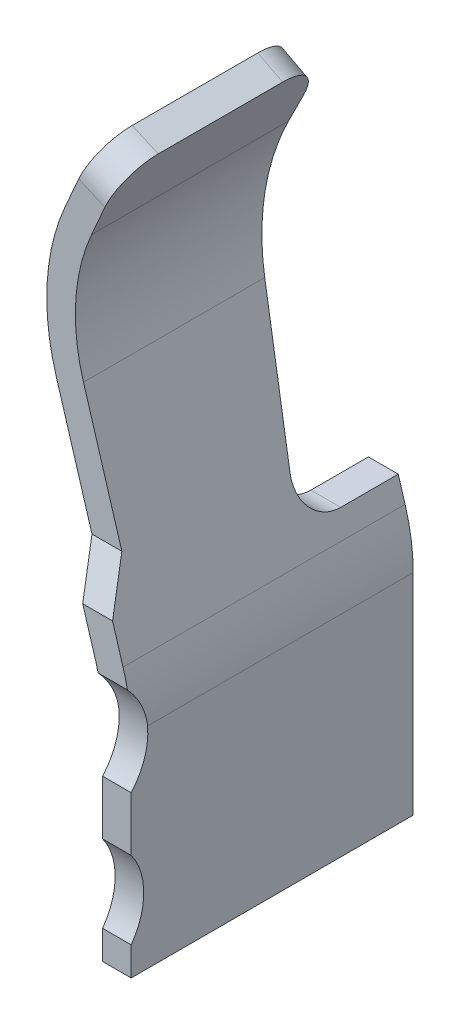
ISO-10303-21;
HEADER;
FILE_DESCRIPTION(('STEP AP214'),'2;1');
FILE_NAME('part.step','',(''),(''),'','','');
FILE_SCHEMA(('AUTOMOTIVE_DESIGN { 1 0 10303 214 1 1 1 1 }'));
ENDSEC;
DATA;
#1=APPLICATION_CONTEXT('core data for automotive mechanical design processes');
#2=APPLICATION_PROTOCOL_DEFINITION('international standard','automotive_design',2000,#1);
#3=PRODUCT_CONTEXT('',#1,'mechanical');
#4=PRODUCT('Part','Part','',(#3));
#5=PRODUCT_RELATED_PRODUCT_CATEGORY('part','',(#4));
#6=PRODUCT_DEFINITION_FORMATION('','',#4);
#7=PRODUCT_DEFINITION_CONTEXT('part definition',#1,'design');
#8=PRODUCT_DEFINITION('design','',#6,#7);
#9=PRODUCT_DEFINITION_SHAPE('','',#8);
#10=(LENGTH_UNIT() NAMED_UNIT(*) SI_UNIT(.MILLI.,.METRE.));
#11=(NAMED_UNIT(*) PLANE_ANGLE_UNIT() SI_UNIT($,.RADIAN.));
#12=(NAMED_UNIT(*) SI_UNIT($,.STERADIAN.) SOLID_ANGLE_UNIT());
#13=UNCERTAINTY_MEASURE_WITH_UNIT(LENGTH_MEASURE(1.E-05),#10,'distance_accuracy_value','');
#14=(GEOMETRIC_REPRESENTATION_CONTEXT(3) GLOBAL_UNCERTAINTY_ASSIGNED_CONTEXT((#13)) GLOBAL_UNIT_ASSIGNED_CONTEXT((#10,
#11,#12)) REPRESENTATION_CONTEXT('',''));
#15=CARTESIAN_POINT('',(0.,0.,0.));
#16=DIRECTION('',(0.,0.,1.));
#17=DIRECTION('',(1.,0.,0.));
#18=AXIS2_PLACEMENT_3D('',#15,#16,#17);
#19=CARTESIAN_POINT('',(-13.3615550668189,3.52330708865174,0.423604352914839));
#20=DIRECTION('',(0.915327071470026,-0.402711251685505,0.));
#21=DIRECTION('',(0.402711251685505,0.915327071470026,0.));
#22=AXIS2_PLACEMENT_3D('',#19,#20,#21);
#23=CYLINDRICAL_SURFACE('',#22,0.2);
#24=CARTESIAN_POINT('',(-13.3615550668189,3.52330708865174,0.423604352914839));
#25=DIRECTION('',(-0.915327071470029,0.402711251685498,0.));
#26=DIRECTION('',(0.402711251685498,0.915327071470029,0.));
#27=AXIS2_PLACEMENT_3D('',#24,#25,#26);
#28=CIRCLE('',#27,0.2);
#29=CARTESIAN_POINT('',(-13.3615550668189,3.52330708865174,0.623604352914839));
#30=VERTEX_POINT('',#29);
#31=CARTESIAN_POINT('',(-13.2810128164818,3.70637250294574,0.423604352914839));
#32=VERTEX_POINT('',#31);
#33=EDGE_CURVE('E363',#30,#32,#28,.T.);
#34=ORIENTED_EDGE('',*,*,#33,.F.);
#35=DIRECTION('',(-0.915327071470027,0.402711251685503,0.));
#36=VECTOR('',#35,1.);
#37=CARTESIAN_POINT('',(-37.9715059297134,14.3508073613119,0.623604352914805));
#38=LINE('',#37,#36);
#39=CARTESIAN_POINT('',(-13.2242560060984,3.46290040089891,0.623604352914839));
#40=VERTEX_POINT('',#39);
#41=EDGE_CURVE('E27',#40,#30,#38,.T.);
#42=ORIENTED_EDGE('',*,*,#41,.F.);
#43=CARTESIAN_POINT('',(-13.2242560060984,3.46290040089891,0.423604352914839));
#44=DIRECTION('',(0.915327071470029,-0.402711251685498,0.));
#45=DIRECTION('',(-0.402711251685498,-0.915327071470029,0.));
#46=AXIS2_PLACEMENT_3D('',#43,#44,#45);
#47=CIRCLE('',#46,0.2);
#48=CARTESIAN_POINT('',(-13.1437137557613,3.64596581519291,0.423604352914839));
#49=VERTEX_POINT('',#48);
#50=EDGE_CURVE('E224',#49,#40,#47,.T.);
#51=ORIENTED_EDGE('',*,*,#50,.F.);
#52=DIRECTION('',(0.915327071470027,-0.402711251685503,0.));
#53=VECTOR('',#52,1.);
#54=CARTESIAN_POINT('',(-13.2810128164818,3.70637250294574,0.423604352914839));
#55=LINE('',#54,#53);
#56=EDGE_CURVE('E402',#32,#49,#55,.T.);
#57=ORIENTED_EDGE('',*,*,#56,.F.);
#58=EDGE_LOOP('',(#34,#42,#51,#57));
#59=FACE_BOUND('',#58,.T.);
#60=ADVANCED_FACE('F16',(#59),#23,.T.);
#61=CARTESIAN_POINT('',(-13.38386274133,3.53312166947706,-0.236832722369337));
#62=DIRECTION('',(-0.914255270392897,0.402239697454475,-0.0483789866630451));
#63=DIRECTION('',(-0.402711251685505,-0.915327071470026,0.));
#64=AXIS2_PLACEMENT_3D('',#61,#62,#63);
#65=CYLINDRICAL_SURFACE('',#64,0.2);
#66=CARTESIAN_POINT('',(-13.2330594619542,3.44289092405021,-0.427421697659668));
#67=CARTESIAN_POINT('',(-13.1819825348076,3.55898426375477,-0.441384710680955));
#68=CARTESIAN_POINT('',(-13.1437137557613,3.64596581519291,-0.356133634256614));
#69=CARTESIAN_POINT('',(-13.1437137557613,3.64596581519291,-0.228386927890316));
#70=(BOUNDED_CURVE() B_SPLINE_CURVE(3,(#66,#67,#68,#69),.UNSPECIFIED.,.F.,
.F.) B_SPLINE_CURVE_WITH_KNOTS((4,4),(6.17366415670651,7.85398163397443),
.UNSPECIFIED.) CURVE() GEOMETRIC_REPRESENTATION_ITEM() RATIONAL_B_SPLINE_CURVE((1.,
0.778229742533869,0.778229742533869,1.)) REPRESENTATION_ITEM(''));
#71=CARTESIAN_POINT('',(-13.2330594619542,3.44289092405021,-0.427421697659668));
#72=VERTEX_POINT('',#71);
#73=CARTESIAN_POINT('',(-13.1437137557613,3.64596581519291,-0.228386927890316));
#74=VERTEX_POINT('',#73);
#75=EDGE_CURVE('E234',#72,#74,#70,.T.);
#76=ORIENTED_EDGE('',*,*,#75,.F.);
#77=DIRECTION('',(0.914255270392898,-0.402239697454473,0.0483789866630451));
#78=VECTOR('',#77,1.);
#79=CARTESIAN_POINT('',(-38.571852655037,14.5910558161891,-1.76825633941021));
#80=LINE('',#79,#78);
#81=CARTESIAN_POINT('',(-13.3703585226747,3.50329761180303,-0.434687053017796));
#82=VERTEX_POINT('',#81);
#83=EDGE_CURVE('E11',#82,#72,#80,.T.);
#84=ORIENTED_EDGE('',*,*,#83,.F.);
#85=CARTESIAN_POINT('',(-13.2810128164818,3.70637250294574,-0.235652283248443));
#86=CARTESIAN_POINT('',(-13.2810128164818,3.70637250294574,-0.363398989614741));
#87=CARTESIAN_POINT('',(-13.3192815955281,3.61939095150759,-0.448650066039082));
#88=CARTESIAN_POINT('',(-13.3703585226747,3.50329761180303,-0.434687053017796));
#89=(BOUNDED_CURVE() B_SPLINE_CURVE(3,(#85,#86,#87,#88),.UNSPECIFIED.,.F.,
.F.) B_SPLINE_CURVE_WITH_KNOTS((4,4),(4.71238898038476,6.39270645765268),
.UNSPECIFIED.) CURVE() GEOMETRIC_REPRESENTATION_ITEM() RATIONAL_B_SPLINE_CURVE((1.,
0.778229742533871,0.778229742533871,1.)) REPRESENTATION_ITEM(''));
#90=CARTESIAN_POINT('',(-13.2810128164818,3.70637250294574,-0.235652283248443));
#91=VERTEX_POINT('',#90);
#92=EDGE_CURVE('E286',#91,#82,#89,.T.);
#93=ORIENTED_EDGE('',*,*,#92,.F.);
#94=DIRECTION('',(-0.914255270392898,0.402239697454473,-0.0483789866630451));
#95=VECTOR('',#94,1.);
#96=CARTESIAN_POINT('',(-13.3033204909929,3.71618708377106,-0.236832722369337));
#97=LINE('',#96,#95);
#98=EDGE_CURVE('E362',#74,#91,#97,.T.);
#99=ORIENTED_EDGE('',*,*,#98,.F.);
#100=EDGE_LOOP('',(#76,#84,#93,#99));
#101=FACE_BOUND('',#100,.T.);
#102=ADVANCED_FACE('F700',(#101),#65,.T.);
#103=CARTESIAN_POINT('',(-43.43,1.65634067151207,-0.212546111318104));
#104=DIRECTION('',(0.,-1.,0.));
#105=DIRECTION('',(0.,0.,-1.));
#106=AXIS2_PLACEMENT_3D('',#103,#104,#105);
#107=PLANE('',#106);
#108=DIRECTION('',(0.,0.,-1.));
#109=VECTOR('',#108,1.);
#110=CARTESIAN_POINT('',(-13.2051649210585,1.65634067151207,-0.740000000000018));
#111=LINE('',#110,#109);
#112=CARTESIAN_POINT('',(-13.2051649210585,1.65634067151207,-0.438042305987952));
#113=VERTEX_POINT('',#112);
#114=CARTESIAN_POINT('',(-13.2051649210585,1.65634067151207,-0.740000000000018));
#115=VERTEX_POINT('',#114);
#116=EDGE_CURVE('E311',#113,#115,#111,.T.);
#117=ORIENTED_EDGE('',*,*,#116,.F.);
#118=DIRECTION('',(1.,0.,0.));
#119=VECTOR('',#118,1.);
#120=CARTESIAN_POINT('',(-13.0484965908944,1.65634067151207,-0.438042305987951));
#121=LINE('',#120,#119);
#122=CARTESIAN_POINT('',(-13.0484965908944,1.65634067151207,-0.438042305987951));
#123=VERTEX_POINT('',#122);
#124=EDGE_CURVE('E438',#113,#123,#121,.T.);
#125=ORIENTED_EDGE('',*,*,#124,.T.);
#126=DIRECTION('',(0.,0.,1.));
#127=VECTOR('',#126,1.);
#128=CARTESIAN_POINT('',(-13.0484965908944,1.65634067151207,-0.740000000000018));
#129=LINE('',#128,#127);
#130=CARTESIAN_POINT('',(-13.0484965908944,1.65634067151207,-0.740000000000018));
#131=VERTEX_POINT('',#130);
#132=EDGE_CURVE('E119',#131,#123,#129,.T.);
#133=ORIENTED_EDGE('',*,*,#132,.F.);
#134=DIRECTION('',(-1.,0.,0.));
#135=VECTOR('',#134,1.);
#136=CARTESIAN_POINT('',(-13.97,1.65634067151207,-0.740000000000019));
#137=LINE('',#136,#135);
#138=EDGE_CURVE('E328',#131,#115,#137,.T.);
#139=ORIENTED_EDGE('',*,*,#138,.T.);
#140=EDGE_LOOP('',(#117,#125,#133,#139));
#141=FACE_BOUND('',#140,.T.);
#142=ADVANCED_FACE('F704',(#141),#107,.F.);
#143=CARTESIAN_POINT('',(-43.43,3.70637250294571,-0.459111687165995));
#144=DIRECTION('',(0.,0.119413416546905,0.992844618230162));
#145=DIRECTION('',(1.,0.,0.));
#146=AXIS2_PLACEMENT_3D('',#143,#144,#145);
#147=PLANE('',#146);
#148=DIRECTION('',(-0.28674853992682,0.951150986717314,-0.11439875574724));
#149=VECTOR('',#148,1.);
#150=CARTESIAN_POINT('',(-13.0303360451115,1.59610175610151,-0.205300934614502));
#151=LINE('',#150,#149);
#152=CARTESIAN_POINT('',(-13.1159916925664,1.88022335482146,-0.239473382341919));
#153=VERTEX_POINT('',#152);
#154=CARTESIAN_POINT('',(-13.3365862640963,2.61194022573825,-0.327479914176621));
#155=VERTEX_POINT('',#154);
#156=EDGE_CURVE('E136',#153,#155,#151,.T.);
#157=ORIENTED_EDGE('',*,*,#156,.F.);
#158=DIRECTION('',(-1.,0.,0.));
#159=VECTOR('',#158,1.);
#160=CARTESIAN_POINT('',(-13.2051649210585,1.88022335482146,-0.23947338234192));
#161=LINE('',#160,#159);
#162=CARTESIAN_POINT('',(-13.2726600227304,1.88022335482146,-0.23947338234192));
#163=VERTEX_POINT('',#162);
#164=EDGE_CURVE('E412',#153,#163,#161,.T.);
#165=ORIENTED_EDGE('',*,*,#164,.T.);
#166=DIRECTION('',(0.286748539926818,-0.951150986717315,0.11439875574724));
#167=VECTOR('',#166,1.);
#168=CARTESIAN_POINT('',(-13.1741223648881,1.55337185451571,-0.200161637444145));
#169=LINE('',#168,#167);
#170=CARTESIAN_POINT('',(-13.4802017604538,2.56864369924933,-0.322272466749579));
#171=VERTEX_POINT('',#170);
#172=EDGE_CURVE('E256',#171,#163,#169,.T.);
#173=ORIENTED_EDGE('',*,*,#172,.F.);
#174=CARTESIAN_POINT('',(-13.4317757539039,3.36370167510267,-0.417897288102545));
#175=CARTESIAN_POINT('',(-13.5433007949067,3.11021511680704,-0.387409439934768));
#176=CARTESIAN_POINT('',(-13.560137394596,2.83379189253285,-0.354162906673266));
#177=CARTESIAN_POINT('',(-13.4802017604538,2.56864369924933,-0.322272466749579));
#178=(BOUNDED_CURVE() B_SPLINE_CURVE(3,(#174,#175,#176,#177),.UNSPECIFIED.,.F.,
.F.) B_SPLINE_CURVE_WITH_KNOTS((4,4),(4.29791199977039,5.00519872138853),
.UNSPECIFIED.) CURVE() GEOMETRIC_REPRESENTATION_ITEM() RATIONAL_B_SPLINE_CURVE((1.,
0.958744787021091,0.958744787021091,1.)) REPRESENTATION_ITEM(''));
#179=CARTESIAN_POINT('',(-13.4317757539039,3.36370167510267,-0.417897288102545));
#180=VERTEX_POINT('',#179);
#181=EDGE_CURVE('E289',#180,#171,#178,.T.);
#182=ORIENTED_EDGE('',*,*,#181,.F.);
#183=DIRECTION('',(-0.400292818236851,-0.909830186054405,0.109428936813832));
#184=VECTOR('',#183,1.);
#185=CARTESIAN_POINT('',(-13.4176664899118,3.39577078475993,-0.421754368938234));
#186=LINE('',#185,#184);
#187=EDGE_CURVE('E279',#82,#180,#186,.T.);
#188=ORIENTED_EDGE('',*,*,#187,.F.);
#189=ORIENTED_EDGE('',*,*,#83,.T.);
#190=DIRECTION('',(0.400292818236852,0.909830186054405,-0.109428936813832));
#191=VECTOR('',#190,1.);
#192=CARTESIAN_POINT('',(-13.2800491803441,3.33608744850051,-0.414576013974332));
#193=LINE('',#192,#191);
#194=CARTESIAN_POINT('',(-13.2944766931834,3.30329498734983,-0.410631932744417));
#195=VERTEX_POINT('',#194);
#196=EDGE_CURVE('E396',#195,#72,#193,.T.);
#197=ORIENTED_EDGE('',*,*,#196,.F.);
#198=CARTESIAN_POINT('',(-13.3365862640963,2.61194022573825,-0.327479914176621));
#199=CARTESIAN_POINT('',(-13.4060955111766,2.84250387207174,-0.355210731501565));
#200=CARTESIAN_POINT('',(-13.3914549897076,3.08287189317973,-0.384120760424611));
#201=CARTESIAN_POINT('',(-13.2944766931834,3.30329498734983,-0.410631932744417));
#202=(BOUNDED_CURVE() B_SPLINE_CURVE(3,(#198,#199,#200,#201),.UNSPECIFIED.,.F.,
.F.) B_SPLINE_CURVE_WITH_KNOTS((4,4),(1.27798658579106,1.98527330740919),
.UNSPECIFIED.) CURVE() GEOMETRIC_REPRESENTATION_ITEM() RATIONAL_B_SPLINE_CURVE((1.,
0.958744787021091,0.958744787021091,1.)) REPRESENTATION_ITEM(''));
#203=EDGE_CURVE('E319',#155,#195,#202,.T.);
#204=ORIENTED_EDGE('',*,*,#203,.F.);
#205=EDGE_LOOP('',(#157,#165,#173,#182,#188,#189,#197,#204));
#206=FACE_BOUND('',#205,.T.);
#207=ADVANCED_FACE('F290',(#206),#147,.F.);
#208=CARTESIAN_POINT('',(-43.43,1.94413292378283,0.623604352914797));
#209=DIRECTION('',(0.,0.,-1.));
#210=DIRECTION('',(0.,-1.,0.));
#211=AXIS2_PLACEMENT_3D('',#208,#209,#210);
#212=PLANE('',#211);
#213=DIRECTION('',(-0.402711251685501,-0.915327071470028,0.));
#214=VECTOR('',#213,1.);
#215=CARTESIAN_POINT('',(-13.2944766931834,3.30329498734984,0.623604352914839));
#216=LINE('',#215,#214);
#217=CARTESIAN_POINT('',(-13.2944766931834,3.30329498734984,0.623604352914839));
#218=VERTEX_POINT('',#217);
#219=EDGE_CURVE('E424',#40,#218,#216,.T.);
#220=ORIENTED_EDGE('',*,*,#219,.F.);
#221=ORIENTED_EDGE('',*,*,#41,.T.);
#222=DIRECTION('',(0.4027112516855,0.915327071470028,0.));
#223=VECTOR('',#222,1.);
#224=CARTESIAN_POINT('',(-13.4317757539039,3.36370167510267,0.623604352914839));
#225=LINE('',#224,#223);
#226=CARTESIAN_POINT('',(-13.4317757539039,3.36370167510267,0.623604352914839));
#227=VERTEX_POINT('',#226);
#228=EDGE_CURVE('E270',#227,#30,#225,.T.);
#229=ORIENTED_EDGE('',*,*,#228,.F.);
#230=CARTESIAN_POINT('',(-12.3791496217134,2.90058373566433,0.62360435291484));
#231=DIRECTION('',(0.,0.,-1.));
#232=DIRECTION('',(-1.,0.,0.));
#233=AXIS2_PLACEMENT_3D('',#230,#231,#232);
#234=CIRCLE('',#233,1.15);
#235=CARTESIAN_POINT('',(-13.4802017604538,2.56864369924933,0.623604352914839));
#236=VERTEX_POINT('',#235);
#237=EDGE_CURVE('E294',#236,#227,#234,.T.);
#238=ORIENTED_EDGE('',*,*,#237,.F.);
#239=DIRECTION('',(-0.288643509926088,0.957436642382956,0.));
#240=VECTOR('',#239,1.);
#241=CARTESIAN_POINT('',(-13.1561788539745,1.49385284836845,0.623604352914839));
#242=LINE('',#241,#240);
#243=CARTESIAN_POINT('',(-13.2919271799357,1.94413292378283,0.623604352914839));
#244=VERTEX_POINT('',#243);
#245=EDGE_CURVE('E305',#244,#236,#242,.T.);
#246=ORIENTED_EDGE('',*,*,#245,.F.);
#247=DIRECTION('',(1.,0.,0.));
#248=VECTOR('',#247,1.);
#249=CARTESIAN_POINT('',(-43.43,1.94413292378283,0.623604352914797));
#250=LINE('',#249,#248);
#251=CARTESIAN_POINT('',(-13.1352588497716,1.94413292378283,0.623604352914839));
#252=VERTEX_POINT('',#251);
#253=EDGE_CURVE('E332',#244,#252,#250,.T.);
#254=ORIENTED_EDGE('',*,*,#253,.T.);
#255=DIRECTION('',(0.28864350992609,-0.957436642382956,0.));
#256=VECTOR('',#255,1.);
#257=CARTESIAN_POINT('',(-13.012563357617,1.53714937485737,0.623604352914839));
#258=LINE('',#257,#256);
#259=CARTESIAN_POINT('',(-13.3365862640963,2.61194022573825,0.623604352914839));
#260=VERTEX_POINT('',#259);
#261=EDGE_CURVE('E325',#260,#252,#258,.T.);
#262=ORIENTED_EDGE('',*,*,#261,.F.);
#263=CARTESIAN_POINT('',(-12.3791496217134,2.90058373566433,0.62360435291484));
#264=DIRECTION('',(0.,0.,1.));
#265=DIRECTION('',(-1.,0.,0.));
#266=AXIS2_PLACEMENT_3D('',#263,#264,#265);
#267=CIRCLE('',#266,1.);
#268=EDGE_CURVE('E388',#218,#260,#267,.T.);
#269=ORIENTED_EDGE('',*,*,#268,.F.);
#270=EDGE_LOOP('',(#220,#221,#229,#238,#246,#254,#262,#269));
#271=FACE_BOUND('',#270,.T.);
#272=ADVANCED_FACE('F1000',(#271),#212,.F.);
#273=CARTESIAN_POINT('',(-43.43,1.7003498353216,0.749999999999972));
#274=DIRECTION('',(0.,-0.460287319631494,-0.887770005906065));
#275=DIRECTION('',(0.,-0.887770005906065,0.460287319631494));
#276=AXIS2_PLACEMENT_3D('',#273,#274,#275);
#277=PLANE('',#276);
#278=DIRECTION('',(-1.,0.,0.));
#279=VECTOR('',#278,1.);
#280=CARTESIAN_POINT('',(-13.97,1.7196371362757,0.739999999999981));
#281=LINE('',#280,#279);
#282=CARTESIAN_POINT('',(-13.0675789123207,1.7196371362757,0.739999999999982));
#283=VERTEX_POINT('',#282);
#284=CARTESIAN_POINT('',(-13.2242472424848,1.7196371362757,0.739999999999982));
#285=VERTEX_POINT('',#284);
#286=EDGE_CURVE('E446',#283,#285,#281,.T.);
#287=ORIENTED_EDGE('',*,*,#286,.F.);
#288=DIRECTION('',(0.258541028225372,-0.857586072334425,0.444637678635293));
#289=VECTOR('',#288,1.);
#290=CARTESIAN_POINT('',(-13.1935765616936,2.13757401070795,0.523309818502748));
#291=LINE('',#290,#289);
#292=EDGE_CURVE('E321',#252,#283,#291,.T.);
#293=ORIENTED_EDGE('',*,*,#292,.F.);
#294=ORIENTED_EDGE('',*,*,#253,.F.);
#295=DIRECTION('',(-0.258541028225371,0.857586072334425,-0.444637678635293));
#296=VECTOR('',#295,1.);
#297=CARTESIAN_POINT('',(-13.3397726380838,2.10283732290249,0.541319952677684));
#298=LINE('',#297,#296);
#299=EDGE_CURVE('E431',#285,#244,#298,.T.);
#300=ORIENTED_EDGE('',*,*,#299,.F.);
#301=EDGE_LOOP('',(#287,#293,#294,#300));
#302=FACE_BOUND('',#301,.T.);
#303=ADVANCED_FACE('F533',(#302),#277,.F.);
#304=CARTESIAN_POINT('',(-13.97,1.24850586493128,0.739999999999981));
#305=DIRECTION('',(0.,0.,-1.));
#306=DIRECTION('',(0.,-1.,0.));
#307=AXIS2_PLACEMENT_3D('',#304,#305,#306);
#308=PLANE('',#307);
#309=DIRECTION('',(0.,-1.,0.));
#310=VECTOR('',#309,1.);
#311=CARTESIAN_POINT('',(-12.97,0.145965815192914,0.739999999999982));
#312=LINE('',#311,#310);
#313=CARTESIAN_POINT('',(-12.97,0.296740599868486,0.739999999999982));
#314=VERTEX_POINT('',#313);
#315=CARTESIAN_POINT('',(-12.97,0.145965815192914,0.739999999999982));
#316=VERTEX_POINT('',#315);
#317=EDGE_CURVE('E329',#314,#316,#312,.T.);
#318=ORIENTED_EDGE('',*,*,#317,.F.);
#319=DIRECTION('',(-1.,0.,0.));
#320=VECTOR('',#319,1.);
#321=CARTESIAN_POINT('',(-43.43,0.296740599868486,0.73999999999994));
#322=LINE('',#321,#320);
#323=CARTESIAN_POINT('',(-13.12,0.296740599868486,0.739999999999982));
#324=VERTEX_POINT('',#323);
#325=EDGE_CURVE('E338',#314,#324,#322,.T.);
#326=ORIENTED_EDGE('',*,*,#325,.T.);
#327=DIRECTION('',(0.,1.,0.));
#328=VECTOR('',#327,1.);
#329=CARTESIAN_POINT('',(-13.12,0.145965815192914,0.739999999999982));
#330=LINE('',#329,#328);
#331=CARTESIAN_POINT('',(-13.12,0.145965815192914,0.739999999999982));
#332=VERTEX_POINT('',#331);
#333=EDGE_CURVE('E379',#332,#324,#330,.T.);
#334=ORIENTED_EDGE('',*,*,#333,.F.);
#335=DIRECTION('',(-1.,0.,0.));
#336=VECTOR('',#335,1.);
#337=CARTESIAN_POINT('',(-13.12,0.145965815192914,0.739999999999982));
#338=LINE('',#337,#336);
#339=EDGE_CURVE('E347',#316,#332,#338,.T.);
#340=ORIENTED_EDGE('',*,*,#339,.F.);
#341=EDGE_LOOP('',(#318,#326,#334,#340));
#342=FACE_BOUND('',#341,.T.);
#343=ADVANCED_FACE('F684',(#342),#308,.F.);
#344=CARTESIAN_POINT('',(-13.97,1.24850586493128,-0.740000000000019));
#345=DIRECTION('',(0.,0.,-1.));
#346=DIRECTION('',(0.,-1.,0.));
#347=AXIS2_PLACEMENT_3D('',#344,#345,#346);
#348=PLANE('',#347);
#349=ORIENTED_EDGE('',*,*,#138,.F.);
#350=DIRECTION('',(0.28864350992609,-0.957436642382956,0.));
#351=VECTOR('',#350,1.);
#352=CARTESIAN_POINT('',(-13.012563357617,1.53714937485737,-0.740000000000018));
#353=LINE('',#352,#351);
#354=CARTESIAN_POINT('',(-13.012563357617,1.53714937485737,-0.740000000000018));
#355=VERTEX_POINT('',#354);
#356=EDGE_CURVE('E384',#131,#355,#353,.T.);
#357=ORIENTED_EDGE('',*,*,#356,.T.);
#358=CARTESIAN_POINT('',(-13.97,1.24850586493128,-0.740000000000019));
#359=DIRECTION('',(0.,0.,-1.));
#360=DIRECTION('',(-1.,0.,0.));
#361=AXIS2_PLACEMENT_3D('',#358,#359,#360);
#362=CIRCLE('',#361,1.);
#363=CARTESIAN_POINT('',(-12.97,1.24850586493128,-0.740000000000018));
#364=VERTEX_POINT('',#363);
#365=EDGE_CURVE('E481',#355,#364,#362,.T.);
#366=ORIENTED_EDGE('',*,*,#365,.T.);
#367=DIRECTION('',(0.,-1.,0.));
#368=VECTOR('',#367,1.);
#369=CARTESIAN_POINT('',(-12.97,0.145965815192914,-0.740000000000018));
#370=LINE('',#369,#368);
#371=CARTESIAN_POINT('',(-12.97,0.145965815192914,-0.740000000000018));
#372=VERTEX_POINT('',#371);
#373=EDGE_CURVE('E42',#364,#372,#370,.T.);
#374=ORIENTED_EDGE('',*,*,#373,.T.);
#375=DIRECTION('',(-1.,0.,0.));
#376=VECTOR('',#375,1.);
#377=CARTESIAN_POINT('',(-13.12,0.145965815192914,-0.740000000000018));
#378=LINE('',#377,#376);
#379=CARTESIAN_POINT('',(-13.12,0.145965815192914,-0.740000000000018));
#380=VERTEX_POINT('',#379);
#381=EDGE_CURVE('E358',#372,#380,#378,.T.);
#382=ORIENTED_EDGE('',*,*,#381,.T.);
#383=DIRECTION('',(0.,1.,0.));
#384=VECTOR('',#383,1.);
#385=CARTESIAN_POINT('',(-13.12,0.145965815192914,-0.740000000000018));
#386=LINE('',#385,#384);
#387=CARTESIAN_POINT('',(-13.12,1.24850586493128,-0.740000000000018));
#388=VERTEX_POINT('',#387);
#389=EDGE_CURVE('E383',#380,#388,#386,.T.);
#390=ORIENTED_EDGE('',*,*,#389,.T.);
#391=CARTESIAN_POINT('',(-13.97,1.24850586493128,-0.740000000000019));
#392=DIRECTION('',(0.,0.,1.));
#393=DIRECTION('',(-1.,0.,0.));
#394=AXIS2_PLACEMENT_3D('',#391,#392,#393);
#395=CIRCLE('',#394,0.85);
#396=CARTESIAN_POINT('',(-13.1561788539745,1.49385284836845,-0.740000000000018));
#397=VERTEX_POINT('',#396);
#398=EDGE_CURVE('E470',#388,#397,#395,.T.);
#399=ORIENTED_EDGE('',*,*,#398,.T.);
#400=DIRECTION('',(-0.288643509926088,0.957436642382956,0.));
#401=VECTOR('',#400,1.);
#402=CARTESIAN_POINT('',(-13.1561788539745,1.49385284836845,-0.740000000000018));
#403=LINE('',#402,#401);
#404=EDGE_CURVE('E313',#397,#115,#403,.T.);
#405=ORIENTED_EDGE('',*,*,#404,.T.);
#406=EDGE_LOOP('',(#349,#357,#366,#374,#382,#390,#399,#405));
#407=FACE_BOUND('',#406,.T.);
#408=ADVANCED_FACE('F18',(#407),#348,.T.);
#409=CARTESIAN_POINT('',(-12.97,0.145965815192914,-0.740000000000018));
#410=DIRECTION('',(-1.,0.,0.));
#411=DIRECTION('',(0.,0.,1.));
#412=AXIS2_PLACEMENT_3D('',#409,#410,#411);
#413=PLANE('',#412);
#414=DIRECTION('',(0.,0.,1.));
#415=VECTOR('',#414,1.);
#416=CARTESIAN_POINT('',(-12.97,1.24850586493128,-0.740000000000018));
#417=LINE('',#416,#415);
#418=CARTESIAN_POINT('',(-12.97,1.24850586493128,0.654029100989327));
#419=VERTEX_POINT('',#418);
#420=EDGE_CURVE('E476',#364,#419,#417,.T.);
#421=ORIENTED_EDGE('',*,*,#420,.T.);
#422=CARTESIAN_POINT('',(-12.97,1.21669179396546,0.995153761033099));
#423=DIRECTION('',(1.,0.,0.));
#424=DIRECTION('',(0.,0.,1.));
#425=AXIS2_PLACEMENT_3D('',#422,#423,#424);
#426=CIRCLE('',#425,0.342604974863759);
#427=CARTESIAN_POINT('',(-12.97,0.988055123608201,0.739999999999982));
#428=VERTEX_POINT('',#427);
#429=EDGE_CURVE('E410',#428,#419,#426,.T.);
#430=ORIENTED_EDGE('',*,*,#429,.F.);
#431=DIRECTION('',(0.,-1.,0.));
#432=VECTOR('',#431,1.);
#433=CARTESIAN_POINT('',(-12.97,0.145965815192914,0.739999999999982));
#434=LINE('',#433,#432);
#435=CARTESIAN_POINT('',(-12.97,0.703259400131467,0.739999999999982));
#436=VERTEX_POINT('',#435);
#437=EDGE_CURVE('E348',#428,#436,#434,.T.);
#438=ORIENTED_EDGE('',*,*,#437,.T.);
#439=CARTESIAN_POINT('',(-12.97,0.499999999999977,1.01942683457021));
#440=DIRECTION('',(1.,0.,0.));
#441=DIRECTION('',(0.,0.,1.));
#442=AXIS2_PLACEMENT_3D('',#439,#440,#441);
#443=CIRCLE('',#442,0.345533991988848);
#444=EDGE_CURVE('E342',#314,#436,#443,.T.);
#445=ORIENTED_EDGE('',*,*,#444,.F.);
#446=ORIENTED_EDGE('',*,*,#317,.T.);
#447=DIRECTION('',(0.,0.,1.));
#448=VECTOR('',#447,1.);
#449=CARTESIAN_POINT('',(-12.97,0.145965815192914,-0.740000000000018));
#450=LINE('',#449,#448);
#451=EDGE_CURVE('E353',#372,#316,#450,.T.);
#452=ORIENTED_EDGE('',*,*,#451,.F.);
#453=ORIENTED_EDGE('',*,*,#373,.F.);
#454=EDGE_LOOP('',(#421,#430,#438,#445,#446,#452,#453));
#455=FACE_BOUND('',#454,.T.);
#456=ADVANCED_FACE('F531',(#455),#413,.F.);
#457=CARTESIAN_POINT('',(-13.97,1.24850586493128,-0.740000000000019));
#458=DIRECTION('',(0.,0.,1.));
#459=DIRECTION('',(1.,0.,0.));
#460=AXIS2_PLACEMENT_3D('',#457,#458,#459);
#461=CYLINDRICAL_SURFACE('',#460,1.);
#462=CARTESIAN_POINT('',(-13.97,1.24850586493128,0.739999999999981));
#463=DIRECTION('',(0.,0.,-1.));
#464=DIRECTION('',(-1.,0.,0.));
#465=AXIS2_PLACEMENT_3D('',#462,#463,#464);
#466=CIRCLE('',#465,1.);
#467=CARTESIAN_POINT('',(-13.012563357617,1.53714937485737,0.739999999999982));
#468=VERTEX_POINT('',#467);
#469=CARTESIAN_POINT('',(-12.9895608818653,1.44532846432271,0.739999999999982));
#470=VERTEX_POINT('',#469);
#471=EDGE_CURVE('E556',#468,#470,#466,.T.);
#472=ORIENTED_EDGE('',*,*,#471,.T.);
#473=CARTESIAN_POINT('',(-12.9895608818653,1.44532846432271,0.739999999999982));
#474=CARTESIAN_POINT('',(-12.9888786825832,1.44193024717415,0.736954698545483));
#475=CARTESIAN_POINT('',(-12.9882027814915,1.43847176034261,0.733975045899647));
#476=CARTESIAN_POINT('',(-12.986871440474,1.43145643098154,0.728168909339827));
#477=CARTESIAN_POINT('',(-12.9862159106837,1.42790021102147,0.725341693611728));
#478=CARTESIAN_POINT('',(-12.9849283118302,1.42068928784935,0.719840380711008));
#479=CARTESIAN_POINT('',(-12.9842961617207,1.41703501951568,0.717165732805341));
#480=CARTESIAN_POINT('',(-12.9830584278734,1.40962817005595,0.711969336935122));
#481=CARTESIAN_POINT('',(-12.9824527844787,1.40587584366096,0.709447240161576));
#482=CARTESIAN_POINT('',(-12.9812712287031,1.39827302810681,0.704555749407115));
#483=CARTESIAN_POINT('',(-12.9806952911115,1.3944226264711,0.702186225501711));
#484=CARTESIAN_POINT('',(-12.979576382774,1.38662388081484,0.697599649617144));
#485=CARTESIAN_POINT('',(-12.9790334341832,1.3826754734274,0.69538269997563));
#486=CARTESIAN_POINT('',(-12.97798380395,1.37468096295884,0.691101059928042));
#487=CARTESIAN_POINT('',(-12.9774772042611,1.3706346650176,0.689036713287184));
#488=CARTESIAN_POINT('',(-12.976503648406,1.36244473872731,0.685059955148846));
#489=CARTESIAN_POINT('',(-12.9760368456039,1.35830080604147,0.683148133100285));
#490=CARTESIAN_POINT('',(-12.9751461489827,1.34991442649085,0.679475891500457));
#491=CARTESIAN_POINT('',(-12.974722504929,1.3456715635432,0.677716361222163));
#492=CARTESIAN_POINT('',(-12.9739264719421,1.33713872195209,0.67437603386877));
#493=CARTESIAN_POINT('',(-12.973553810649,1.33284913740262,0.672794295796519));
#494=CARTESIAN_POINT('',(-12.9728613614521,1.32422362544475,0.669809238507238));
#495=CARTESIAN_POINT('',(-12.97254136585,1.31988795555412,0.668405223722607));
#496=CARTESIAN_POINT('',(-12.9719558558899,1.31117101253237,0.665775382478343));
#497=CARTESIAN_POINT('',(-12.9716902085753,1.3067898789237,0.664549123358626));
#498=CARTESIAN_POINT('',(-12.9712150063215,1.29798278695386,0.662274523841756));
#499=CARTESIAN_POINT('',(-12.9710054020393,1.29355687160833,0.661226027233363));
#500=CARTESIAN_POINT('',(-12.9706438877592,1.28466100981363,0.659306657193394));
#501=CARTESIAN_POINT('',(-12.9704920194512,1.28019103392972,0.658435912321199));
#502=CARTESIAN_POINT('',(-12.9702476084813,1.27120787033419,0.656871822149776));
#503=CARTESIAN_POINT('',(-12.9701552042987,1.26669460642045,0.656178893183953));
#504=CARTESIAN_POINT('',(-12.9700312436239,1.25762568522575,0.654969909316684));
#505=CARTESIAN_POINT('',(-12.969999925878,1.25306993125333,0.654454554866669));
#506=CARTESIAN_POINT('',(-12.97,1.24850586493128,0.654029100989326));
#507=B_SPLINE_CURVE_WITH_KNOTS('',3,(#473,#474,#475,#476,#477,#478,#479,#480,#481,#482,#483,
#484,#485,#486,#487,#488,#489,#490,#491,#492,#493,#494,#495,#496,#497,#498,#499,#500,#501,#502,
#503,#504,#505,#506),.UNSPECIFIED.,.F.,.F.,(4,2,2,2,2,2,2,2,2,2,2,2,2,2,2,2,4),(0.,
0.0138407212062908,0.0276076629972265,0.0413212735163105,0.0550022400255596,0.0686713979832378,
0.0823496367921826,0.0960578043230458,0.109816612381111,0.123650992269169,0.137408310969936,
0.151110002599828,0.164777762983116,0.178433449670591,0.192098978145682,0.20579621664963,
0.219546882133365),.UNSPECIFIED.);
#508=EDGE_CURVE('E551',#470,#419,#507,.T.);
#509=ORIENTED_EDGE('',*,*,#508,.T.);
#510=ORIENTED_EDGE('',*,*,#420,.F.);
#511=ORIENTED_EDGE('',*,*,#365,.F.);
#512=DIRECTION('',(0.,0.,1.));
#513=VECTOR('',#512,1.);
#514=CARTESIAN_POINT('',(-13.012563357617,1.53714937485737,-0.740000000000018));
#515=LINE('',#514,#513);
#516=EDGE_CURVE('E324',#355,#468,#515,.T.);
#517=ORIENTED_EDGE('',*,*,#516,.T.);
#518=EDGE_LOOP('',(#472,#509,#510,#511,#517));
#519=FACE_BOUND('',#518,.T.);
#520=ADVANCED_FACE('F526',(#519),#461,.T.);
#521=CARTESIAN_POINT('',(-13.012563357617,1.53714937485737,-0.740000000000018));
#522=DIRECTION('',(-0.957436642382956,-0.28864350992609,0.));
#523=DIRECTION('',(-0.28864350992609,0.957436642382956,0.));
#524=AXIS2_PLACEMENT_3D('',#521,#522,#523);
#525=PLANE('',#524);
#526=ORIENTED_EDGE('',*,*,#356,.F.);
#527=ORIENTED_EDGE('',*,*,#132,.T.);
#528=CARTESIAN_POINT('',(-13.0484965908944,1.65634067151207,-0.438042305987951));
#529=CARTESIAN_POINT('',(-13.0484965908944,1.65634067151208,-0.320885018462571));
#530=CARTESIAN_POINT('',(-13.0734716234365,1.73918338398669,-0.238042305987951));
#531=CARTESIAN_POINT('',(-13.1087916531782,1.85634067151208,-0.238042305987952));
#532=(BOUNDED_CURVE() B_SPLINE_CURVE(3,(#528,#529,#530,#531),.UNSPECIFIED.,.F.,
.F.) B_SPLINE_CURVE_WITH_KNOTS((4,4),(3.1415926535898,4.71238898038469),
.UNSPECIFIED.) CURVE() GEOMETRIC_REPRESENTATION_ITEM() RATIONAL_B_SPLINE_CURVE((1.,
0.804737854124365,0.804737854124365,1.)) REPRESENTATION_ITEM(''));
#533=CARTESIAN_POINT('',(-13.1087916531782,1.85634067151208,-0.238042305987952));
#534=VERTEX_POINT('',#533);
#535=EDGE_CURVE('E370',#123,#534,#532,.T.);
#536=ORIENTED_EDGE('',*,*,#535,.T.);
#537=CARTESIAN_POINT('',(-13.1087916531782,1.85634067151208,-0.238042305987952));
#538=CARTESIAN_POINT('',(-13.1111988444155,1.86432537588468,-0.238042305987952));
#539=CARTESIAN_POINT('',(-13.1136017257014,1.87229578405696,-0.23851990151267));
#540=CARTESIAN_POINT('',(-13.1159916925664,1.88022335482146,-0.239473382341919));
#541=(BOUNDED_CURVE() B_SPLINE_CURVE(3,(#537,#538,#539,#540),.UNSPECIFIED.,.F.,
.F.) B_SPLINE_CURVE_WITH_KNOTS((4,4),(4.71238898038469,4.83208803082147),
.UNSPECIFIED.) CURVE() GEOMETRIC_REPRESENTATION_ITEM() RATIONAL_B_SPLINE_CURVE((1.,
0.998806367803328,0.998806367803328,1.)) REPRESENTATION_ITEM(''));
#542=EDGE_CURVE('E364',#534,#153,#541,.T.);
#543=ORIENTED_EDGE('',*,*,#542,.T.);
#544=ORIENTED_EDGE('',*,*,#156,.T.);
#545=DIRECTION('',(0.,0.,1.));
#546=VECTOR('',#545,1.);
#547=CARTESIAN_POINT('',(-13.3365862640963,2.61194022573825,-0.740000000000018));
#548=LINE('',#547,#546);
#549=EDGE_CURVE('E315',#155,#260,#548,.T.);
#550=ORIENTED_EDGE('',*,*,#549,.T.);
#551=ORIENTED_EDGE('',*,*,#261,.T.);
#552=ORIENTED_EDGE('',*,*,#292,.T.);
#553=DIRECTION('',(0.28864350992609,-0.957436642382956,0.));
#554=VECTOR('',#553,1.);
#555=CARTESIAN_POINT('',(-13.012563357617,1.53714937485737,0.739999999999982));
#556=LINE('',#555,#554);
#557=EDGE_CURVE('E378',#283,#468,#556,.T.);
#558=ORIENTED_EDGE('',*,*,#557,.T.);
#559=ORIENTED_EDGE('',*,*,#516,.F.);
#560=EDGE_LOOP('',(#526,#527,#536,#543,#544,#550,#551,#552,#558,#559));
#561=FACE_BOUND('',#560,.T.);
#562=ADVANCED_FACE('F530',(#561),#525,.F.);
#563=CARTESIAN_POINT('',(-12.3791496217134,2.90058373566433,-0.740000000000017));
#564=DIRECTION('',(0.,0.,1.));
#565=DIRECTION('',(1.,0.,0.));
#566=AXIS2_PLACEMENT_3D('',#563,#564,#565);
#567=CYLINDRICAL_SURFACE('',#566,1.);
#568=ORIENTED_EDGE('',*,*,#549,.F.);
#569=ORIENTED_EDGE('',*,*,#203,.T.);
#570=DIRECTION('',(0.,0.,1.));
#571=VECTOR('',#570,1.);
#572=CARTESIAN_POINT('',(-13.2944766931834,3.30329498734983,-0.740000000000018));
#573=LINE('',#572,#571);
#574=EDGE_CURVE('E320',#195,#218,#573,.T.);
#575=ORIENTED_EDGE('',*,*,#574,.T.);
#576=ORIENTED_EDGE('',*,*,#268,.T.);
#577=EDGE_LOOP('',(#568,#569,#575,#576));
#578=FACE_BOUND('',#577,.T.);
#579=ADVANCED_FACE('F714',(#578),#567,.F.);
#580=CARTESIAN_POINT('',(-13.2944766931834,3.30329498734984,-0.740000000000018));
#581=DIRECTION('',(-0.915327071470028,0.402711251685501,0.));
#582=DIRECTION('',(0.,0.,1.));
#583=AXIS2_PLACEMENT_3D('',#580,#581,#582);
#584=PLANE('',#583);
#585=ORIENTED_EDGE('',*,*,#196,.T.);
#586=ORIENTED_EDGE('',*,*,#75,.T.);
#587=DIRECTION('',(0.,0.,1.));
#588=VECTOR('',#587,1.);
#589=CARTESIAN_POINT('',(-13.1437137557613,3.64596581519291,-0.740000000000018));
#590=LINE('',#589,#588);
#591=EDGE_CURVE('E359',#74,#49,#590,.T.);
#592=ORIENTED_EDGE('',*,*,#591,.T.);
#593=ORIENTED_EDGE('',*,*,#50,.T.);
#594=ORIENTED_EDGE('',*,*,#219,.T.);
#595=ORIENTED_EDGE('',*,*,#574,.F.);
#596=EDGE_LOOP('',(#585,#586,#592,#593,#594,#595));
#597=FACE_BOUND('',#596,.T.);
#598=ADVANCED_FACE('F524',(#597),#584,.F.);
#599=CARTESIAN_POINT('',(-13.2810128164818,3.70637250294574,-0.740000000000018));
#600=DIRECTION('',(-0.402711251685503,-0.915327071470027,0.));
#601=DIRECTION('',(-0.915327071470027,0.402711251685503,0.));
#602=AXIS2_PLACEMENT_3D('',#599,#600,#601);
#603=PLANE('',#602);
#604=ORIENTED_EDGE('',*,*,#591,.F.);
#605=ORIENTED_EDGE('',*,*,#98,.T.);
#606=DIRECTION('',(0.,0.,1.));
#607=VECTOR('',#606,1.);
#608=CARTESIAN_POINT('',(-13.2810128164818,3.70637250294574,-0.740000000000018));
#609=LINE('',#608,#607);
#610=EDGE_CURVE('E337',#91,#32,#609,.T.);
#611=ORIENTED_EDGE('',*,*,#610,.T.);
#612=ORIENTED_EDGE('',*,*,#56,.T.);
#613=EDGE_LOOP('',(#604,#605,#611,#612));
#614=FACE_BOUND('',#613,.T.);
#615=ADVANCED_FACE('F709',(#614),#603,.F.);
#616=CARTESIAN_POINT('',(-13.4317757539039,3.36370167510267,-0.740000000000018));
#617=DIRECTION('',(0.915327071470028,-0.4027112516855,0.));
#618=DIRECTION('',(0.,0.,-1.));
#619=AXIS2_PLACEMENT_3D('',#616,#617,#618);
#620=PLANE('',#619);
#621=ORIENTED_EDGE('',*,*,#610,.F.);
#622=ORIENTED_EDGE('',*,*,#92,.T.);
#623=ORIENTED_EDGE('',*,*,#187,.T.);
#624=DIRECTION('',(0.,0.,1.));
#625=VECTOR('',#624,1.);
#626=CARTESIAN_POINT('',(-13.4317757539039,3.36370167510267,-0.740000000000018));
#627=LINE('',#626,#625);
#628=EDGE_CURVE('E284',#180,#227,#627,.T.);
#629=ORIENTED_EDGE('',*,*,#628,.T.);
#630=ORIENTED_EDGE('',*,*,#228,.T.);
#631=ORIENTED_EDGE('',*,*,#33,.T.);
#632=EDGE_LOOP('',(#621,#622,#623,#629,#630,#631));
#633=FACE_BOUND('',#632,.T.);
#634=ADVANCED_FACE('F282',(#633),#620,.F.);
#635=CARTESIAN_POINT('',(-12.3791496217134,2.90058373566433,-0.740000000000017));
#636=DIRECTION('',(0.,0.,1.));
#637=DIRECTION('',(1.,0.,0.));
#638=AXIS2_PLACEMENT_3D('',#635,#636,#637);
#639=CYLINDRICAL_SURFACE('',#638,1.15);
#640=ORIENTED_EDGE('',*,*,#628,.F.);
#641=ORIENTED_EDGE('',*,*,#181,.T.);
#642=DIRECTION('',(0.,0.,1.));
#643=VECTOR('',#642,1.);
#644=CARTESIAN_POINT('',(-13.4802017604538,2.56864369924933,-0.740000000000019));
#645=LINE('',#644,#643);
#646=EDGE_CURVE('E298',#171,#236,#645,.T.);
#647=ORIENTED_EDGE('',*,*,#646,.T.);
#648=ORIENTED_EDGE('',*,*,#237,.T.);
#649=EDGE_LOOP('',(#640,#641,#647,#648));
#650=FACE_BOUND('',#649,.T.);
#651=ADVANCED_FACE('F296',(#650),#639,.T.);
#652=CARTESIAN_POINT('',(-13.1561788539745,1.49385284836845,-0.740000000000018));
#653=DIRECTION('',(0.957436642382956,0.288643509926088,0.));
#654=DIRECTION('',(0.,0.,-1.));
#655=AXIS2_PLACEMENT_3D('',#652,#653,#654);
#656=PLANE('',#655);
#657=ORIENTED_EDGE('',*,*,#172,.T.);
#658=CARTESIAN_POINT('',(-13.2726600227304,1.88022335482146,-0.23947338234192));
#659=CARTESIAN_POINT('',(-13.2702700558654,1.87229578405696,-0.23851990151267));
#660=CARTESIAN_POINT('',(-13.2678671745795,1.86432537588468,-0.238042305987952));
#661=CARTESIAN_POINT('',(-13.2654599833422,1.85634067151208,-0.238042305987952));
#662=(BOUNDED_CURVE() B_SPLINE_CURVE(3,(#658,#659,#660,#661),.UNSPECIFIED.,.F.,
.F.) B_SPLINE_CURVE_WITH_KNOTS((4,4),(1.45109727635811,1.5707963267949),
.UNSPECIFIED.) CURVE() GEOMETRIC_REPRESENTATION_ITEM() RATIONAL_B_SPLINE_CURVE((1.,
0.998806367803328,0.998806367803328,1.)) REPRESENTATION_ITEM(''));
#663=CARTESIAN_POINT('',(-13.2654599833422,1.85634067151208,-0.238042305987952));
#664=VERTEX_POINT('',#663);
#665=EDGE_CURVE('E265',#163,#664,#662,.T.);
#666=ORIENTED_EDGE('',*,*,#665,.T.);
#667=CARTESIAN_POINT('',(-13.2654599833422,1.85634067151208,-0.238042305987952));
#668=CARTESIAN_POINT('',(-13.2301399536005,1.73918338398669,-0.238042305987952));
#669=CARTESIAN_POINT('',(-13.2051649210585,1.65634067151208,-0.320885018462571));
#670=CARTESIAN_POINT('',(-13.2051649210585,1.65634067151207,-0.438042305987952));
#671=(BOUNDED_CURVE() B_SPLINE_CURVE(3,(#667,#668,#669,#670),.UNSPECIFIED.,.F.,
.F.) B_SPLINE_CURVE_WITH_KNOTS((4,4),(1.5707963267949,3.1415926535898),
.UNSPECIFIED.) CURVE() GEOMETRIC_REPRESENTATION_ITEM() RATIONAL_B_SPLINE_CURVE((1.,
0.804737854124365,0.804737854124365,1.)) REPRESENTATION_ITEM(''));
#672=EDGE_CURVE('E441',#664,#113,#671,.T.);
#673=ORIENTED_EDGE('',*,*,#672,.T.);
#674=ORIENTED_EDGE('',*,*,#116,.T.);
#675=ORIENTED_EDGE('',*,*,#404,.F.);
#676=DIRECTION('',(0.,0.,1.));
#677=VECTOR('',#676,1.);
#678=CARTESIAN_POINT('',(-13.1561788539745,1.49385284836845,-0.740000000000018));
#679=LINE('',#678,#677);
#680=CARTESIAN_POINT('',(-13.1561788539745,1.49385284836845,0.739999999999982));
#681=VERTEX_POINT('',#680);
#682=EDGE_CURVE('E382',#397,#681,#679,.T.);
#683=ORIENTED_EDGE('',*,*,#682,.T.);
#684=DIRECTION('',(-0.288643509926088,0.957436642382956,0.));
#685=VECTOR('',#684,1.);
#686=CARTESIAN_POINT('',(-13.1561788539745,1.49385284836845,0.739999999999982));
#687=LINE('',#686,#685);
#688=EDGE_CURVE('E453',#681,#285,#687,.T.);
#689=ORIENTED_EDGE('',*,*,#688,.T.);
#690=ORIENTED_EDGE('',*,*,#299,.T.);
#691=ORIENTED_EDGE('',*,*,#245,.T.);
#692=ORIENTED_EDGE('',*,*,#646,.F.);
#693=EDGE_LOOP('',(#657,#666,#673,#674,#675,#683,#689,#690,#691,#692));
#694=FACE_BOUND('',#693,.T.);
#695=ADVANCED_FACE('F523',(#694),#656,.F.);
#696=CARTESIAN_POINT('',(-13.97,1.24850586493128,-0.740000000000019));
#697=DIRECTION('',(0.,0.,1.));
#698=DIRECTION('',(1.,0.,0.));
#699=AXIS2_PLACEMENT_3D('',#696,#697,#698);
#700=CYLINDRICAL_SURFACE('',#699,0.85);
#701=DIRECTION('',(0.,0.,1.));
#702=VECTOR('',#701,1.);
#703=CARTESIAN_POINT('',(-13.12,1.24850586493128,-0.740000000000018));
#704=LINE('',#703,#702);
#705=CARTESIAN_POINT('',(-13.12,1.24850586493128,0.654029100989327));
#706=VERTEX_POINT('',#705);
#707=EDGE_CURVE('E357',#388,#706,#704,.T.);
#708=ORIENTED_EDGE('',*,*,#707,.T.);
#709=CARTESIAN_POINT('',(-13.12,1.24850586493128,0.654029100989326));
#710=CARTESIAN_POINT('',(-13.1199999120981,1.25307172693067,0.654454720262649));
#711=CARTESIAN_POINT('',(-13.1200367860582,1.2576292439298,0.654970441218028));
#712=CARTESIAN_POINT('',(-13.1201827631079,1.26670316475256,0.65618058097096));
#713=CARTESIAN_POINT('',(-13.1202916142837,1.27121965647092,0.656874371378044));
#714=CARTESIAN_POINT('',(-13.1205795966021,1.28021043459181,0.658440607166898));
#715=CARTESIAN_POINT('',(-13.1207585933334,1.28468478505202,0.659312709351936));
#716=CARTESIAN_POINT('',(-13.1211847902787,1.29359026706937,0.661235215653679));
#717=CARTESIAN_POINT('',(-13.1214319692244,1.2980214116583,0.662285564130242));
#718=CARTESIAN_POINT('',(-13.1219924970805,1.30683955789782,0.664564290110306));
#719=CARTESIAN_POINT('',(-13.1223059308903,1.31122649527137,0.66579289539336));
#720=CARTESIAN_POINT('',(-13.1229969364554,1.319955383038,0.668427852265581));
#721=CARTESIAN_POINT('',(-13.1233746903479,1.32429716745941,0.66983470562738));
#722=CARTESIAN_POINT('',(-13.1241923236228,1.33293499859296,0.672825870710029));
#723=CARTESIAN_POINT('',(-13.124632471781,1.3372307560841,0.674410943694402));
#724=CARTESIAN_POINT('',(-13.1255728895693,1.34577581205583,0.677758358644036));
#725=CARTESIAN_POINT('',(-13.126073502642,1.35002467970643,0.679521703002878));
#726=CARTESIAN_POINT('',(-13.127124693327,1.3584100270012,0.683196490683954));
#727=CARTESIAN_POINT('',(-13.1276748333784,1.36254713822216,0.685106618702928));
#728=CARTESIAN_POINT('',(-13.1288224407836,1.37072413591787,0.68907981392322));
#729=CARTESIAN_POINT('',(-13.1294197526585,1.37476428891432,0.691142377362184));
#730=CARTESIAN_POINT('',(-13.1306576588271,1.38274714659962,0.695420264462097));
#731=CARTESIAN_POINT('',(-13.1312981780944,1.38669000475761,0.697635323456164));
#732=CARTESIAN_POINT('',(-13.1326185655259,1.39447822720199,0.702217943436169));
#733=CARTESIAN_POINT('',(-13.1332984257206,1.39832361100925,0.704585473545551));
#734=CARTESIAN_POINT('',(-13.1346936622195,1.40591692940921,0.709472808735765));
#735=CARTESIAN_POINT('',(-13.135409083347,1.40966473145108,0.711992806913413));
#736=CARTESIAN_POINT('',(-13.1368717189092,1.41706305442156,0.717184847198581));
#737=CARTESIAN_POINT('',(-13.1376190162216,1.42071327585317,0.719857292619004));
#738=CARTESIAN_POINT('',(-13.1391417772644,1.42791663066827,0.725354048734536));
#739=CARTESIAN_POINT('',(-13.1399173470941,1.43146928614062,0.72817895593544));
#740=CARTESIAN_POINT('',(-13.141493178097,1.43847803402675,0.733980340906966));
#741=CARTESIAN_POINT('',(-13.1422935544036,1.44193346413615,0.736957587769694));
#742=CARTESIAN_POINT('',(-13.1431016601971,1.44532846432271,0.739999999999982));
#743=B_SPLINE_CURVE_WITH_KNOTS('',3,(#709,#710,#711,#712,#713,#714,#715,#716,#717,#718,#719,
#720,#721,#722,#723,#724,#725,#726,#727,#728,#729,#730,#731,#732,#733,#734,#735,#736,#737,#738,
#739,#740,#741,#742),.UNSPECIFIED.,.F.,.F.,(4,2,2,2,2,2,2,2,2,2,2,2,2,2,2,2,4),(0.,
0.0137560099806957,0.0274641281894255,0.0411461066330988,0.0548238220336575,0.0685191715445094,
0.0822539679803124,0.0960498370492208,0.109928118966897,0.123693986122861,0.137416236293081,
0.151115243354292,0.164811484933297,0.178525451068202,0.192277552593382,0.206088031282537,
0.219976873694124),.UNSPECIFIED.);
#744=CARTESIAN_POINT('',(-13.1431016601971,1.44532846432271,0.739999999999982));
#745=VERTEX_POINT('',#744);
#746=EDGE_CURVE('E352',#706,#745,#743,.T.);
#747=ORIENTED_EDGE('',*,*,#746,.T.);
#748=CARTESIAN_POINT('',(-13.97,1.24850586493128,0.739999999999981));
#749=DIRECTION('',(0.,0.,1.));
#750=DIRECTION('',(-1.,0.,0.));
#751=AXIS2_PLACEMENT_3D('',#748,#749,#750);
#752=CIRCLE('',#751,0.85);
#753=EDGE_CURVE('E467',#745,#681,#752,.T.);
#754=ORIENTED_EDGE('',*,*,#753,.T.);
#755=ORIENTED_EDGE('',*,*,#682,.F.);
#756=ORIENTED_EDGE('',*,*,#398,.F.);
#757=EDGE_LOOP('',(#708,#747,#754,#755,#756));
#758=FACE_BOUND('',#757,.T.);
#759=ADVANCED_FACE('F512',(#758),#700,.F.);
#760=CARTESIAN_POINT('',(-13.12,0.145965815192914,-0.740000000000018));
#761=DIRECTION('',(1.,0.,0.));
#762=DIRECTION('',(0.,0.,1.));
#763=AXIS2_PLACEMENT_3D('',#760,#761,#762);
#764=PLANE('',#763);
#765=DIRECTION('',(0.,1.,0.));
#766=VECTOR('',#765,1.);
#767=CARTESIAN_POINT('',(-13.12,0.145965815192914,0.739999999999982));
#768=LINE('',#767,#766);
#769=CARTESIAN_POINT('',(-13.12,0.703259400131467,0.739999999999982));
#770=VERTEX_POINT('',#769);
#771=CARTESIAN_POINT('',(-13.12,0.988055123608201,0.739999999999982));
#772=VERTEX_POINT('',#771);
#773=EDGE_CURVE('E344',#770,#772,#768,.T.);
#774=ORIENTED_EDGE('',*,*,#773,.T.);
#775=CARTESIAN_POINT('',(-13.12,1.21669179396546,0.995153761033099));
#776=DIRECTION('',(1.,0.,0.));
#777=DIRECTION('',(0.,0.,-1.));
#778=AXIS2_PLACEMENT_3D('',#775,#776,#777);
#779=CIRCLE('',#778,0.342604974863759);
#780=EDGE_CURVE('E411',#772,#706,#779,.T.);
#781=ORIENTED_EDGE('',*,*,#780,.T.);
#782=ORIENTED_EDGE('',*,*,#707,.F.);
#783=ORIENTED_EDGE('',*,*,#389,.F.);
#784=DIRECTION('',(0.,0.,1.));
#785=VECTOR('',#784,1.);
#786=CARTESIAN_POINT('',(-13.12,0.145965815192914,-0.740000000000018));
#787=LINE('',#786,#785);
#788=EDGE_CURVE('E309',#380,#332,#787,.T.);
#789=ORIENTED_EDGE('',*,*,#788,.T.);
#790=ORIENTED_EDGE('',*,*,#333,.T.);
#791=CARTESIAN_POINT('',(-13.12,0.499999999999977,1.01942683457021));
#792=DIRECTION('',(1.,0.,0.));
#793=DIRECTION('',(0.,0.,-1.));
#794=AXIS2_PLACEMENT_3D('',#791,#792,#793);
#795=CIRCLE('',#794,0.345533991988848);
#796=EDGE_CURVE('E343',#324,#770,#795,.T.);
#797=ORIENTED_EDGE('',*,*,#796,.T.);
#798=EDGE_LOOP('',(#774,#781,#782,#783,#789,#790,#797));
#799=FACE_BOUND('',#798,.T.);
#800=ADVANCED_FACE('F522',(#799),#764,.F.);
#801=CARTESIAN_POINT('',(-13.12,0.145965815192914,-0.740000000000018));
#802=DIRECTION('',(0.,1.,0.));
#803=DIRECTION('',(1.,0.,0.));
#804=AXIS2_PLACEMENT_3D('',#801,#802,#803);
#805=PLANE('',#804);
#806=ORIENTED_EDGE('',*,*,#339,.T.);
#807=ORIENTED_EDGE('',*,*,#788,.F.);
#808=ORIENTED_EDGE('',*,*,#381,.F.);
#809=ORIENTED_EDGE('',*,*,#451,.T.);
#810=EDGE_LOOP('',(#806,#807,#808,#809));
#811=FACE_BOUND('',#810,.T.);
#812=ADVANCED_FACE('F680',(#811),#805,.F.);
#813=CARTESIAN_POINT('',(-13.97,1.24850586493128,0.739999999999981));
#814=DIRECTION('',(0.,0.,-1.));
#815=DIRECTION('',(0.,-1.,0.));
#816=AXIS2_PLACEMENT_3D('',#813,#814,#815);
#817=PLANE('',#816);
#818=ORIENTED_EDGE('',*,*,#437,.F.);
#819=DIRECTION('',(-1.,0.,0.));
#820=VECTOR('',#819,1.);
#821=CARTESIAN_POINT('',(-43.43,0.988055123608201,0.73999999999994));
#822=LINE('',#821,#820);
#823=EDGE_CURVE('E406',#428,#772,#822,.T.);
#824=ORIENTED_EDGE('',*,*,#823,.T.);
#825=ORIENTED_EDGE('',*,*,#773,.F.);
#826=DIRECTION('',(1.,0.,0.));
#827=VECTOR('',#826,1.);
#828=CARTESIAN_POINT('',(-43.43,0.703259400131467,0.73999999999994));
#829=LINE('',#828,#827);
#830=EDGE_CURVE('E371',#770,#436,#829,.T.);
#831=ORIENTED_EDGE('',*,*,#830,.T.);
#832=EDGE_LOOP('',(#818,#824,#825,#831));
#833=FACE_BOUND('',#832,.T.);
#834=ADVANCED_FACE('F690',(#833),#817,.F.);
#835=CARTESIAN_POINT('',(-13.97,1.24850586493128,0.739999999999981));
#836=DIRECTION('',(0.,0.,-1.));
#837=DIRECTION('',(0.,-1.,0.));
#838=AXIS2_PLACEMENT_3D('',#835,#836,#837);
#839=PLANE('',#838);
#840=ORIENTED_EDGE('',*,*,#557,.F.);
#841=ORIENTED_EDGE('',*,*,#286,.T.);
#842=ORIENTED_EDGE('',*,*,#688,.F.);
#843=ORIENTED_EDGE('',*,*,#753,.F.);
#844=DIRECTION('',(1.,0.,0.));
#845=VECTOR('',#844,1.);
#846=CARTESIAN_POINT('',(-43.43,1.44532846432271,0.73999999999994));
#847=LINE('',#846,#845);
#848=EDGE_CURVE('E594',#745,#470,#847,.T.);
#849=ORIENTED_EDGE('',*,*,#848,.T.);
#850=ORIENTED_EDGE('',*,*,#471,.F.);
#851=EDGE_LOOP('',(#840,#841,#842,#843,#849,#850));
#852=FACE_BOUND('',#851,.T.);
#853=ADVANCED_FACE('F639',(#852),#839,.F.);
#854=CARTESIAN_POINT('',(-43.43,0.499999999999977,1.01942683457016));
#855=DIRECTION('',(1.,0.,0.));
#856=DIRECTION('',(0.,0.,-1.));
#857=AXIS2_PLACEMENT_3D('',#854,#855,#856);
#858=CYLINDRICAL_SURFACE('',#857,0.345533991988848);
#859=ORIENTED_EDGE('',*,*,#796,.F.);
#860=ORIENTED_EDGE('',*,*,#325,.F.);
#861=ORIENTED_EDGE('',*,*,#444,.T.);
#862=ORIENTED_EDGE('',*,*,#830,.F.);
#863=EDGE_LOOP('',(#859,#860,#861,#862));
#864=FACE_BOUND('',#863,.T.);
#865=ADVANCED_FACE('F569',(#864),#858,.F.);
#866=CARTESIAN_POINT('',(-43.43,1.21669179396546,0.995153761033057));
#867=DIRECTION('',(1.,0.,0.));
#868=DIRECTION('',(0.,0.,-1.));
#869=AXIS2_PLACEMENT_3D('',#866,#867,#868);
#870=CYLINDRICAL_SURFACE('',#869,0.342604974863759);
#871=ORIENTED_EDGE('',*,*,#780,.F.);
#872=ORIENTED_EDGE('',*,*,#823,.F.);
#873=ORIENTED_EDGE('',*,*,#429,.T.);
#874=ORIENTED_EDGE('',*,*,#508,.F.);
#875=ORIENTED_EDGE('',*,*,#848,.F.);
#876=ORIENTED_EDGE('',*,*,#746,.F.);
#877=EDGE_LOOP('',(#871,#872,#873,#874,#875,#876));
#878=FACE_BOUND('',#877,.T.);
#879=ADVANCED_FACE('F558',(#878),#870,.F.);
#880=CARTESIAN_POINT('',(-43.43,1.85634067151208,-0.438042305987994));
#881=DIRECTION('',(-1.,0.,0.));
#882=DIRECTION('',(0.,0.,1.));
#883=AXIS2_PLACEMENT_3D('',#880,#881,#882);
#884=CYLINDRICAL_SURFACE('',#883,0.2);
#885=ORIENTED_EDGE('',*,*,#542,.F.);
#886=ORIENTED_EDGE('',*,*,#535,.F.);
#887=ORIENTED_EDGE('',*,*,#124,.F.);
#888=ORIENTED_EDGE('',*,*,#672,.F.);
#889=ORIENTED_EDGE('',*,*,#665,.F.);
#890=ORIENTED_EDGE('',*,*,#164,.F.);
#891=EDGE_LOOP('',(#885,#886,#887,#888,#889,#890));
#892=FACE_BOUND('',#891,.T.);
#893=ADVANCED_FACE('F568',(#892),#884,.F.);
#894=CLOSED_SHELL('',(#60,#102,#142,#207,#272,#303,#343,#408,#456,#520,#562,#579,#598,#615,#634,
#651,#695,#759,#800,#812,#834,#853,#865,#879,#893));
#895=MANIFOLD_SOLID_BREP('B1',#894);
#896=ADVANCED_BREP_SHAPE_REPRESENTATION('',(#18,#895),#14);
#897=SHAPE_DEFINITION_REPRESENTATION(#9,#896);
ENDSEC;
END-ISO-10303-21;
